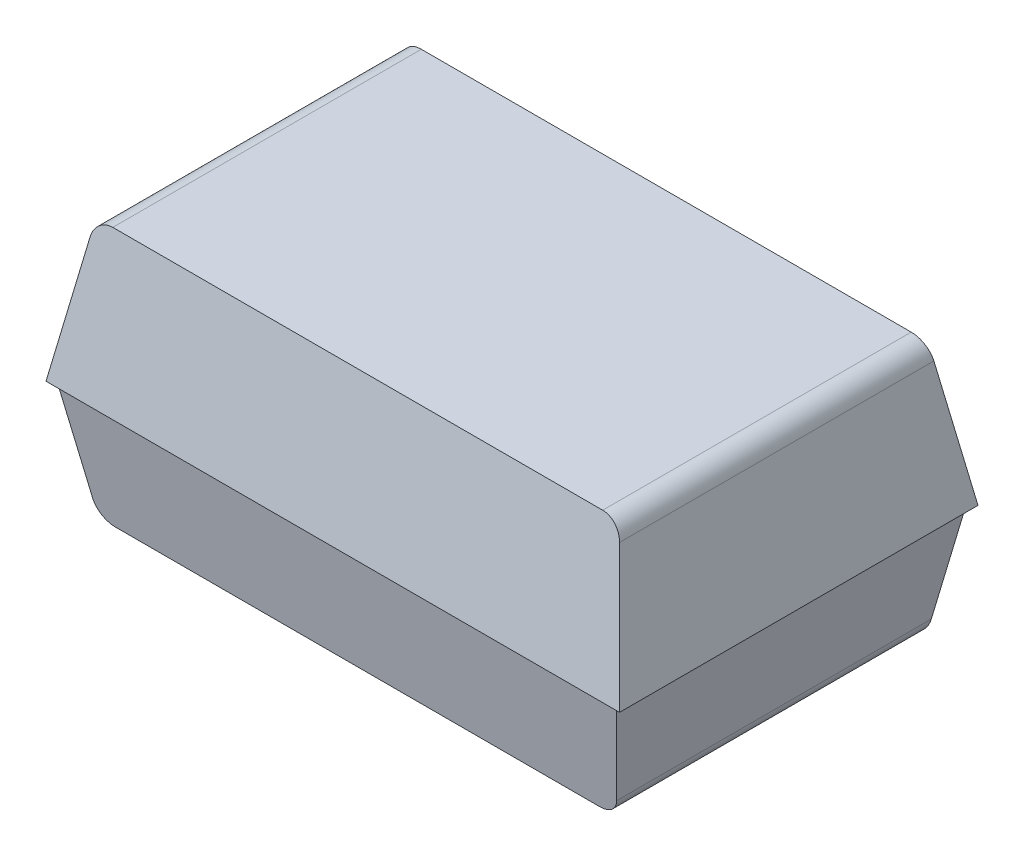
ISO-10303-21;
HEADER;
FILE_DESCRIPTION(('STEP AP214'),'2;1');
FILE_NAME('part.step','',(''),(''),'','','');
FILE_SCHEMA(('AUTOMOTIVE_DESIGN { 1 0 10303 214 1 1 1 1 }'));
ENDSEC;
DATA;
#1=APPLICATION_CONTEXT('core data for automotive mechanical design processes');
#2=APPLICATION_PROTOCOL_DEFINITION('international standard','automotive_design',2000,#1);
#3=PRODUCT_CONTEXT('',#1,'mechanical');
#4=PRODUCT('Part','Part','',(#3));
#5=PRODUCT_RELATED_PRODUCT_CATEGORY('part','',(#4));
#6=PRODUCT_DEFINITION_FORMATION('','',#4);
#7=PRODUCT_DEFINITION_CONTEXT('part definition',#1,'design');
#8=PRODUCT_DEFINITION('design','',#6,#7);
#9=PRODUCT_DEFINITION_SHAPE('','',#8);
#10=(LENGTH_UNIT() NAMED_UNIT(*) SI_UNIT(.MILLI.,.METRE.));
#11=(NAMED_UNIT(*) PLANE_ANGLE_UNIT() SI_UNIT($,.RADIAN.));
#12=(NAMED_UNIT(*) SI_UNIT($,.STERADIAN.) SOLID_ANGLE_UNIT());
#13=UNCERTAINTY_MEASURE_WITH_UNIT(LENGTH_MEASURE(1.E-05),#10,'distance_accuracy_value','');
#14=(GEOMETRIC_REPRESENTATION_CONTEXT(3) GLOBAL_UNCERTAINTY_ASSIGNED_CONTEXT((#13)) GLOBAL_UNIT_ASSIGNED_CONTEXT((#10,
#11,#12)) REPRESENTATION_CONTEXT('',''));
#15=CARTESIAN_POINT('',(0.,0.,0.));
#16=DIRECTION('',(0.,0.,1.));
#17=DIRECTION('',(1.,0.,0.));
#18=AXIS2_PLACEMENT_3D('',#15,#16,#17);
#19=CARTESIAN_POINT('',(0.,-0.406,0.));
#20=DIRECTION('',(0.,-1.,0.));
#21=DIRECTION('',(0.,0.,-1.));
#22=AXIS2_PLACEMENT_3D('',#19,#20,#21);
#23=PLANE('',#22);
#24=DIRECTION('',(1.,0.,0.));
#25=VECTOR('',#24,1.);
#26=CARTESIAN_POINT('',(1.2,-0.406000000000055,0.53841124583231));
#27=LINE('',#26,#25);
#28=CARTESIAN_POINT('',(-0.84467427165,-0.406000000000014,0.538411245832314));
#29=VERTEX_POINT('',#28);
#30=CARTESIAN_POINT('',(0.84467427165,-0.406000000000014,0.538411245832314));
#31=VERTEX_POINT('',#30);
#32=EDGE_CURVE('E144',#29,#31,#27,.T.);
#33=ORIENTED_EDGE('',*,*,#32,.F.);
#34=DIRECTION('',(0.,0.,-1.));
#35=VECTOR('',#34,1.);
#36=CARTESIAN_POINT('',(-0.84467427165,-0.406,1.079009571055));
#37=LINE('',#36,#35);
#38=CARTESIAN_POINT('',(-0.84467427165,-0.406000000000014,-0.538411245832314));
#39=VERTEX_POINT('',#38);
#40=EDGE_CURVE('E97',#39,#29,#37,.F.);
#41=ORIENTED_EDGE('',*,*,#40,.F.);
#42=DIRECTION('',(1.,0.,0.));
#43=VECTOR('',#42,1.);
#44=CARTESIAN_POINT('',(1.2,-0.406000000000055,-0.53841124583231));
#45=LINE('',#44,#43);
#46=CARTESIAN_POINT('',(0.84467427165,-0.406000000000014,-0.538411245832314));
#47=VERTEX_POINT('',#46);
#48=EDGE_CURVE('E169',#39,#47,#45,.T.);
#49=ORIENTED_EDGE('',*,*,#48,.T.);
#50=DIRECTION('',(0.,0.,1.));
#51=VECTOR('',#50,1.);
#52=CARTESIAN_POINT('',(0.84467427165,-0.406,-1.078995464428));
#53=LINE('',#52,#51);
#54=EDGE_CURVE('E114',#31,#47,#53,.F.);
#55=ORIENTED_EDGE('',*,*,#54,.F.);
#56=EDGE_LOOP('',(#33,#41,#49,#55));
#57=FACE_BOUND('',#56,.T.);
#58=ADVANCED_FACE('F17',(#57),#23,.T.);
#59=CARTESIAN_POINT('',(0.84467427165,-0.336,-1.078995464428));
#60=DIRECTION('',(0.,0.,1.));
#61=DIRECTION('',(1.,0.,0.));
#62=AXIS2_PLACEMENT_3D('',#59,#60,#61);
#63=CYLINDRICAL_SURFACE('',#62,0.07);
#64=CARTESIAN_POINT('',(0.84467427165,-0.336,0.55075413448192));
#65=DIRECTION('',(0.,-0.173648177667033,0.98480775301219));
#66=DIRECTION('',(0.,0.98480775301219,0.173648177667033));
#67=AXIS2_PLACEMENT_3D('',#64,#65,#66);
#68=ELLIPSE('',#67,0.0710798628320034,0.07);
#69=CARTESIAN_POINT('',(0.913610814360793,-0.348155372436795,0.548610814360751));
#70=VERTEX_POINT('',#69);
#71=EDGE_CURVE('E163',#31,#70,#68,.T.);
#72=ORIENTED_EDGE('',*,*,#71,.F.);
#73=ORIENTED_EDGE('',*,*,#54,.T.);
#74=CARTESIAN_POINT('',(0.84467427165,-0.336,-0.550754134481919));
#75=DIRECTION('',(0.,0.173648177667033,0.98480775301219));
#76=DIRECTION('',(0.,-0.98480775301219,0.173648177667033));
#77=AXIS2_PLACEMENT_3D('',#74,#75,#76);
#78=ELLIPSE('',#77,0.0710798628320034,0.07);
#79=CARTESIAN_POINT('',(0.913610814360788,-0.348155372436823,-0.548610814360885));
#80=VERTEX_POINT('',#79);
#81=EDGE_CURVE('E167',#47,#80,#78,.T.);
#82=ORIENTED_EDGE('',*,*,#81,.T.);
#83=DIRECTION('',(0.,0.,1.));
#84=VECTOR('',#83,1.);
#85=CARTESIAN_POINT('',(0.913610814360724,-0.348155372436951,0.61));
#86=LINE('',#85,#84);
#87=EDGE_CURVE('E132',#80,#70,#86,.T.);
#88=ORIENTED_EDGE('',*,*,#87,.T.);
#89=EDGE_LOOP('',(#72,#73,#82,#88));
#90=FACE_BOUND('',#89,.T.);
#91=ADVANCED_FACE('F345',(#90),#63,.T.);
#92=CARTESIAN_POINT('',(-0.84467427165,-0.336,1.079009571055));
#93=DIRECTION('',(0.,0.,-1.));
#94=DIRECTION('',(-1.,0.,0.));
#95=AXIS2_PLACEMENT_3D('',#92,#93,#94);
#96=CYLINDRICAL_SURFACE('',#95,0.07);
#97=CARTESIAN_POINT('',(-0.84467427165,-0.336,-0.55075413448192));
#98=DIRECTION('',(0.,0.173648177667033,0.98480775301219));
#99=DIRECTION('',(0.,0.98480775301219,-0.173648177667033));
#100=AXIS2_PLACEMENT_3D('',#97,#98,#99);
#101=ELLIPSE('',#100,0.0710798628320034,0.07);
#102=CARTESIAN_POINT('',(-0.913610814360793,-0.348155372436795,-0.548610814360751));
#103=VERTEX_POINT('',#102);
#104=EDGE_CURVE('E117',#103,#39,#101,.T.);
#105=ORIENTED_EDGE('',*,*,#104,.T.);
#106=ORIENTED_EDGE('',*,*,#40,.T.);
#107=CARTESIAN_POINT('',(-0.84467427165,-0.336,0.550754134481919));
#108=DIRECTION('',(0.,-0.173648177667033,0.98480775301219));
#109=DIRECTION('',(0.,-0.98480775301219,-0.173648177667033));
#110=AXIS2_PLACEMENT_3D('',#107,#108,#109);
#111=ELLIPSE('',#110,0.0710798628320034,0.07);
#112=CARTESIAN_POINT('',(-0.913610814360793,-0.348155372436795,0.548610814360751));
#113=VERTEX_POINT('',#112);
#114=EDGE_CURVE('E158',#113,#29,#111,.T.);
#115=ORIENTED_EDGE('',*,*,#114,.F.);
#116=DIRECTION('',(0.,0.,1.));
#117=VECTOR('',#116,1.);
#118=CARTESIAN_POINT('',(-0.913610814360724,-0.348155372436951,0.61));
#119=LINE('',#118,#117);
#120=EDGE_CURVE('E115',#103,#113,#119,.T.);
#121=ORIENTED_EDGE('',*,*,#120,.F.);
#122=EDGE_LOOP('',(#105,#106,#115,#121));
#123=FACE_BOUND('',#122,.T.);
#124=ADVANCED_FACE('F337',(#123),#96,.T.);
#125=CARTESIAN_POINT('',(1.2,0.494,-0.53789447153));
#126=DIRECTION('',(0.,-0.173648177667033,0.98480775301219));
#127=DIRECTION('',(0.,-0.98480775301219,-0.173648177667033));
#128=AXIS2_PLACEMENT_3D('',#125,#126,#127);
#129=PLANE('',#128);
#130=DIRECTION('',(1.,0.,0.));
#131=VECTOR('',#130,1.);
#132=CARTESIAN_POINT('',(0.,0.,-0.625));
#133=LINE('',#132,#131);
#134=CARTESIAN_POINT('',(1.00000000000002,0.,-0.625000000000012));
#135=VERTEX_POINT('',#134);
#136=CARTESIAN_POINT('',(-1.00000000000001,0.,-0.625));
#137=VERTEX_POINT('',#136);
#138=EDGE_CURVE('E193',#135,#137,#133,.F.);
#139=ORIENTED_EDGE('',*,*,#138,.T.);
#140=DIRECTION('',(-0.171087869746174,-0.970287525248008,-0.171087869744795));
#141=VECTOR('',#140,1.);
#142=CARTESIAN_POINT('',(-0.923094040058414,0.436155372436897,-0.548094040059));
#143=LINE('',#142,#141);
#144=CARTESIAN_POINT('',(-0.923094040058731,0.436155372436813,-0.548094040058725));
#145=VERTEX_POINT('',#144);
#146=EDGE_CURVE('E161',#145,#137,#143,.T.);
#147=ORIENTED_EDGE('',*,*,#146,.F.);
#148=CARTESIAN_POINT('',(-0.854157497348,0.424,-0.5502373601796));
#149=DIRECTION('',(0.,-0.173648177667033,0.98480775301219));
#150=DIRECTION('',(0.,0.98480775301219,0.173648177667033));
#151=AXIS2_PLACEMENT_3D('',#148,#149,#150);
#152=ELLIPSE('',#151,0.0710798628320034,0.07);
#153=CARTESIAN_POINT('',(-0.854157497348,0.494,-0.53789447153));
#154=VERTEX_POINT('',#153);
#155=EDGE_CURVE('E106',#154,#145,#152,.T.);
#156=ORIENTED_EDGE('',*,*,#155,.F.);
#157=DIRECTION('',(1.,0.,0.));
#158=VECTOR('',#157,1.);
#159=CARTESIAN_POINT('',(1.2,0.494,-0.53789447153));
#160=LINE('',#159,#158);
#161=CARTESIAN_POINT('',(0.854157497348,0.494,-0.53789447153));
#162=VERTEX_POINT('',#161);
#163=EDGE_CURVE('E96',#162,#154,#160,.F.);
#164=ORIENTED_EDGE('',*,*,#163,.F.);
#165=CARTESIAN_POINT('',(0.854157497348,0.424,-0.5502373601796));
#166=DIRECTION('',(0.,-0.173648177667033,0.98480775301219));
#167=DIRECTION('',(0.,-0.98480775301219,-0.173648177667033));
#168=AXIS2_PLACEMENT_3D('',#165,#166,#167);
#169=ELLIPSE('',#168,0.0710798628320034,0.07);
#170=CARTESIAN_POINT('',(0.923094040058882,0.436155372436789,-0.548094040058432));
#171=VERTEX_POINT('',#170);
#172=EDGE_CURVE('E20',#171,#162,#169,.T.);
#173=ORIENTED_EDGE('',*,*,#172,.F.);
#174=DIRECTION('',(-0.171087869744795,0.970287525248008,0.171087869746174));
#175=VECTOR('',#174,1.);
#176=CARTESIAN_POINT('',(1.,0.,-0.625000000000034));
#177=LINE('',#176,#175);
#178=EDGE_CURVE('E86',#135,#171,#177,.T.);
#179=ORIENTED_EDGE('',*,*,#178,.F.);
#180=EDGE_LOOP('',(#139,#147,#156,#164,#173,#179));
#181=FACE_BOUND('',#180,.T.);
#182=ADVANCED_FACE('F104',(#181),#129,.F.);
#183=CARTESIAN_POINT('',(-0.975,0.,0.61));
#184=DIRECTION('',(-0.98480775301219,-0.173648177667033,0.));
#185=DIRECTION('',(0.173648177667033,-0.98480775301219,0.));
#186=AXIS2_PLACEMENT_3D('',#183,#184,#185);
#187=PLANE('',#186);
#188=DIRECTION('',(0.171087869745387,-0.970287525247907,0.171087869746157));
#189=VECTOR('',#188,1.);
#190=CARTESIAN_POINT('',(-0.975000000000001,0.,-0.61));
#191=LINE('',#190,#189);
#192=CARTESIAN_POINT('',(-0.975000000000001,0.,-0.61));
#193=VERTEX_POINT('',#192);
#194=EDGE_CURVE('E135',#193,#103,#191,.T.);
#195=ORIENTED_EDGE('',*,*,#194,.T.);
#196=ORIENTED_EDGE('',*,*,#120,.T.);
#197=DIRECTION('',(0.171087869745387,-0.970287525247907,-0.171087869746157));
#198=VECTOR('',#197,1.);
#199=CARTESIAN_POINT('',(-0.975000000000001,0.,0.61));
#200=LINE('',#199,#198);
#201=CARTESIAN_POINT('',(-0.975000000000001,0.,0.61));
#202=VERTEX_POINT('',#201);
#203=EDGE_CURVE('E162',#202,#113,#200,.T.);
#204=ORIENTED_EDGE('',*,*,#203,.F.);
#205=DIRECTION('',(0.,0.,1.));
#206=VECTOR('',#205,1.);
#207=CARTESIAN_POINT('',(-0.975,0.,0.));
#208=LINE('',#207,#206);
#209=EDGE_CURVE('E125',#202,#193,#208,.F.);
#210=ORIENTED_EDGE('',*,*,#209,.T.);
#211=EDGE_LOOP('',(#195,#196,#204,#210));
#212=FACE_BOUND('',#211,.T.);
#213=ADVANCED_FACE('F320',(#212),#187,.T.);
#214=CARTESIAN_POINT('',(1.2,0.,-0.61));
#215=DIRECTION('',(0.,0.173648177667033,0.98480775301219));
#216=DIRECTION('',(0.,-0.98480775301219,0.173648177667033));
#217=AXIS2_PLACEMENT_3D('',#214,#215,#216);
#218=PLANE('',#217);
#219=DIRECTION('',(1.,0.,0.));
#220=VECTOR('',#219,1.);
#221=CARTESIAN_POINT('',(0.,0.,-0.61));
#222=LINE('',#221,#220);
#223=CARTESIAN_POINT('',(0.975,0.,-0.61));
#224=VERTEX_POINT('',#223);
#225=EDGE_CURVE('E128',#193,#224,#222,.T.);
#226=ORIENTED_EDGE('',*,*,#225,.T.);
#227=DIRECTION('',(-0.171087869746157,-0.970287525247907,0.171087869745386));
#228=VECTOR('',#227,1.);
#229=CARTESIAN_POINT('',(0.975,0.,-0.61));
#230=LINE('',#229,#228);
#231=EDGE_CURVE('E134',#224,#80,#230,.T.);
#232=ORIENTED_EDGE('',*,*,#231,.T.);
#233=ORIENTED_EDGE('',*,*,#81,.F.);
#234=ORIENTED_EDGE('',*,*,#48,.F.);
#235=ORIENTED_EDGE('',*,*,#104,.F.);
#236=ORIENTED_EDGE('',*,*,#194,.F.);
#237=EDGE_LOOP('',(#226,#232,#233,#234,#235,#236));
#238=FACE_BOUND('',#237,.T.);
#239=ADVANCED_FACE('F311',(#238),#218,.F.);
#240=CARTESIAN_POINT('',(0.975,0.,0.61));
#241=DIRECTION('',(-0.98480775301219,0.173648177667033,0.));
#242=DIRECTION('',(-0.173648177667033,-0.98480775301219,0.));
#243=AXIS2_PLACEMENT_3D('',#240,#241,#242);
#244=PLANE('',#243);
#245=DIRECTION('',(0.,0.,1.));
#246=VECTOR('',#245,1.);
#247=CARTESIAN_POINT('',(0.975,0.,0.));
#248=LINE('',#247,#246);
#249=CARTESIAN_POINT('',(0.975,0.,0.61));
#250=VERTEX_POINT('',#249);
#251=EDGE_CURVE('E122',#224,#250,#248,.T.);
#252=ORIENTED_EDGE('',*,*,#251,.T.);
#253=DIRECTION('',(0.171087869745386,0.970287525247907,0.171087869746157));
#254=VECTOR('',#253,1.);
#255=CARTESIAN_POINT('',(0.913610814361,-0.348155372436951,0.548610814360724));
#256=LINE('',#255,#254);
#257=EDGE_CURVE('E166',#70,#250,#256,.T.);
#258=ORIENTED_EDGE('',*,*,#257,.F.);
#259=ORIENTED_EDGE('',*,*,#87,.F.);
#260=ORIENTED_EDGE('',*,*,#231,.F.);
#261=EDGE_LOOP('',(#252,#258,#259,#260));
#262=FACE_BOUND('',#261,.T.);
#263=ADVANCED_FACE('F302',(#262),#244,.F.);
#264=CARTESIAN_POINT('',(1.2,0.,0.61));
#265=DIRECTION('',(0.,-0.173648177667033,0.98480775301219));
#266=DIRECTION('',(0.,-0.98480775301219,-0.173648177667033));
#267=AXIS2_PLACEMENT_3D('',#264,#265,#266);
#268=PLANE('',#267);
#269=ORIENTED_EDGE('',*,*,#203,.T.);
#270=ORIENTED_EDGE('',*,*,#114,.T.);
#271=ORIENTED_EDGE('',*,*,#32,.T.);
#272=ORIENTED_EDGE('',*,*,#71,.T.);
#273=ORIENTED_EDGE('',*,*,#257,.T.);
#274=DIRECTION('',(1.,0.,0.));
#275=VECTOR('',#274,1.);
#276=CARTESIAN_POINT('',(0.,0.,0.61));
#277=LINE('',#276,#275);
#278=EDGE_CURVE('E118',#250,#202,#277,.F.);
#279=ORIENTED_EDGE('',*,*,#278,.T.);
#280=EDGE_LOOP('',(#269,#270,#271,#272,#273,#279));
#281=FACE_BOUND('',#280,.T.);
#282=ADVANCED_FACE('F293',(#281),#268,.T.);
#283=CARTESIAN_POINT('',(-0.91289447153,0.494,0.625));
#284=DIRECTION('',(-0.98480775301219,0.173648177667033,0.));
#285=DIRECTION('',(-0.173648177667033,-0.98480775301219,0.));
#286=AXIS2_PLACEMENT_3D('',#283,#284,#285);
#287=PLANE('',#286);
#288=DIRECTION('',(-0.171087869744795,-0.970287525248008,0.171087869746174));
#289=VECTOR('',#288,1.);
#290=CARTESIAN_POINT('',(-0.923094040059001,0.436155372436897,0.548094040058414));
#291=LINE('',#290,#289);
#292=CARTESIAN_POINT('',(-0.923094040058882,0.436155372436789,0.548094040058432));
#293=VERTEX_POINT('',#292);
#294=CARTESIAN_POINT('',(-1.,0.,0.625000000000034));
#295=VERTEX_POINT('',#294);
#296=EDGE_CURVE('E156',#293,#295,#291,.T.);
#297=ORIENTED_EDGE('',*,*,#296,.F.);
#298=DIRECTION('',(0.,0.,1.));
#299=VECTOR('',#298,1.);
#300=CARTESIAN_POINT('',(-0.923094040058805,0.436155372436966,-1.077973923262));
#301=LINE('',#300,#299);
#302=EDGE_CURVE('E157',#145,#293,#301,.T.);
#303=ORIENTED_EDGE('',*,*,#302,.F.);
#304=ORIENTED_EDGE('',*,*,#146,.T.);
#305=DIRECTION('',(0.,0.,1.));
#306=VECTOR('',#305,1.);
#307=CARTESIAN_POINT('',(-1.,0.,0.));
#308=LINE('',#307,#306);
#309=EDGE_CURVE('E129',#137,#295,#308,.T.);
#310=ORIENTED_EDGE('',*,*,#309,.T.);
#311=EDGE_LOOP('',(#297,#303,#304,#310));
#312=FACE_BOUND('',#311,.T.);
#313=ADVANCED_FACE('F238',(#312),#287,.T.);
#314=CARTESIAN_POINT('',(0.,0.,0.));
#315=DIRECTION('',(0.,1.,0.));
#316=DIRECTION('',(0.,0.,1.));
#317=AXIS2_PLACEMENT_3D('',#314,#315,#316);
#318=PLANE('',#317);
#319=ORIENTED_EDGE('',*,*,#251,.F.);
#320=ORIENTED_EDGE('',*,*,#225,.F.);
#321=ORIENTED_EDGE('',*,*,#209,.F.);
#322=ORIENTED_EDGE('',*,*,#278,.F.);
#323=EDGE_LOOP('',(#319,#320,#321,#322));
#324=FACE_BOUND('',#323,.T.);
#325=ORIENTED_EDGE('',*,*,#309,.F.);
#326=ORIENTED_EDGE('',*,*,#138,.F.);
#327=DIRECTION('',(0.,0.,1.));
#328=VECTOR('',#327,1.);
#329=CARTESIAN_POINT('',(1.00000000000003,0.,0.625));
#330=LINE('',#329,#328);
#331=CARTESIAN_POINT('',(1.00000000000001,0.,0.625000000000034));
#332=VERTEX_POINT('',#331);
#333=EDGE_CURVE('E121',#135,#332,#330,.T.);
#334=ORIENTED_EDGE('',*,*,#333,.T.);
#335=DIRECTION('',(1.,0.,0.));
#336=VECTOR('',#335,1.);
#337=CARTESIAN_POINT('',(1.2,0.,0.625000000000034));
#338=LINE('',#337,#336);
#339=EDGE_CURVE('E205',#295,#332,#338,.T.);
#340=ORIENTED_EDGE('',*,*,#339,.F.);
#341=EDGE_LOOP('',(#325,#326,#334,#340));
#342=FACE_BOUND('',#341,.T.);
#343=ADVANCED_FACE('F229',(#324,#342),#318,.F.);
#344=CARTESIAN_POINT('',(0.91289447153,0.494,0.625));
#345=DIRECTION('',(-0.98480775301219,-0.173648177667033,0.));
#346=DIRECTION('',(0.173648177667033,-0.98480775301219,0.));
#347=AXIS2_PLACEMENT_3D('',#344,#345,#346);
#348=PLANE('',#347);
#349=ORIENTED_EDGE('',*,*,#333,.F.);
#350=ORIENTED_EDGE('',*,*,#178,.T.);
#351=DIRECTION('',(0.,0.,-1.));
#352=VECTOR('',#351,1.);
#353=CARTESIAN_POINT('',(0.923094040058805,0.436155372436966,1.077959830175));
#354=LINE('',#353,#352);
#355=CARTESIAN_POINT('',(0.923094040058882,0.436155372436789,0.548094040058431));
#356=VERTEX_POINT('',#355);
#357=EDGE_CURVE('E93',#356,#171,#354,.T.);
#358=ORIENTED_EDGE('',*,*,#357,.F.);
#359=DIRECTION('',(-0.171087869744795,0.970287525248008,-0.171087869746174));
#360=VECTOR('',#359,1.);
#361=CARTESIAN_POINT('',(1.,0.,0.625000000000034));
#362=LINE('',#361,#360);
#363=EDGE_CURVE('E152',#332,#356,#362,.T.);
#364=ORIENTED_EDGE('',*,*,#363,.F.);
#365=EDGE_LOOP('',(#349,#350,#358,#364));
#366=FACE_BOUND('',#365,.T.);
#367=ADVANCED_FACE('F226',(#366),#348,.F.);
#368=CARTESIAN_POINT('',(-0.854157497348,0.424,-1.077973923262));
#369=DIRECTION('',(0.,0.,1.));
#370=DIRECTION('',(1.,0.,0.));
#371=AXIS2_PLACEMENT_3D('',#368,#369,#370);
#372=CYLINDRICAL_SURFACE('',#371,0.07);
#373=CARTESIAN_POINT('',(-0.854157497348,0.424,0.5502373601796));
#374=DIRECTION('',(0.,0.173648177667033,0.98480775301219));
#375=DIRECTION('',(0.,-0.98480775301219,0.173648177667033));
#376=AXIS2_PLACEMENT_3D('',#373,#374,#375);
#377=ELLIPSE('',#376,0.0710798628320034,0.07);
#378=CARTESIAN_POINT('',(-0.854157497348,0.494,0.53789447153));
#379=VERTEX_POINT('',#378);
#380=EDGE_CURVE('E153',#379,#293,#377,.T.);
#381=ORIENTED_EDGE('',*,*,#380,.F.);
#382=DIRECTION('',(0.,0.,1.));
#383=VECTOR('',#382,1.);
#384=CARTESIAN_POINT('',(-0.854157497348,0.494,0.));
#385=LINE('',#384,#383);
#386=EDGE_CURVE('E213',#154,#379,#385,.T.);
#387=ORIENTED_EDGE('',*,*,#386,.F.);
#388=ORIENTED_EDGE('',*,*,#155,.T.);
#389=ORIENTED_EDGE('',*,*,#302,.T.);
#390=EDGE_LOOP('',(#381,#387,#388,#389));
#391=FACE_BOUND('',#390,.T.);
#392=ADVANCED_FACE('F228',(#391),#372,.T.);
#393=CARTESIAN_POINT('',(1.2,0.494,0.53789447153));
#394=DIRECTION('',(0.,0.173648177667033,0.98480775301219));
#395=DIRECTION('',(0.,-0.98480775301219,0.173648177667033));
#396=AXIS2_PLACEMENT_3D('',#393,#394,#395);
#397=PLANE('',#396);
#398=ORIENTED_EDGE('',*,*,#363,.T.);
#399=CARTESIAN_POINT('',(0.854157497348,0.424,0.5502373601796));
#400=DIRECTION('',(0.,0.173648177667033,0.98480775301219));
#401=DIRECTION('',(0.,0.98480775301219,-0.173648177667033));
#402=AXIS2_PLACEMENT_3D('',#399,#400,#401);
#403=ELLIPSE('',#402,0.0710798628320034,0.07);
#404=CARTESIAN_POINT('',(0.854157497348,0.494,0.53789447153));
#405=VERTEX_POINT('',#404);
#406=EDGE_CURVE('E35',#405,#356,#403,.F.);
#407=ORIENTED_EDGE('',*,*,#406,.F.);
#408=DIRECTION('',(1.,0.,0.));
#409=VECTOR('',#408,1.);
#410=CARTESIAN_POINT('',(0.,0.494,0.53789447153));
#411=LINE('',#410,#409);
#412=EDGE_CURVE('E26',#379,#405,#411,.T.);
#413=ORIENTED_EDGE('',*,*,#412,.F.);
#414=ORIENTED_EDGE('',*,*,#380,.T.);
#415=ORIENTED_EDGE('',*,*,#296,.T.);
#416=ORIENTED_EDGE('',*,*,#339,.T.);
#417=EDGE_LOOP('',(#398,#407,#413,#414,#415,#416));
#418=FACE_BOUND('',#417,.T.);
#419=ADVANCED_FACE('F224',(#418),#397,.T.);
#420=CARTESIAN_POINT('',(0.854157497348,0.424,1.077959830175));
#421=DIRECTION('',(0.,0.,-1.));
#422=DIRECTION('',(-1.,0.,0.));
#423=AXIS2_PLACEMENT_3D('',#420,#421,#422);
#424=CYLINDRICAL_SURFACE('',#423,0.07);
#425=ORIENTED_EDGE('',*,*,#172,.T.);
#426=DIRECTION('',(0.,0.,1.));
#427=VECTOR('',#426,1.);
#428=CARTESIAN_POINT('',(0.854157497348,0.494,0.));
#429=LINE('',#428,#427);
#430=EDGE_CURVE('E11',#405,#162,#429,.F.);
#431=ORIENTED_EDGE('',*,*,#430,.F.);
#432=ORIENTED_EDGE('',*,*,#406,.T.);
#433=ORIENTED_EDGE('',*,*,#357,.T.);
#434=EDGE_LOOP('',(#425,#431,#432,#433));
#435=FACE_BOUND('',#434,.T.);
#436=ADVANCED_FACE('F91',(#435),#424,.T.);
#437=CARTESIAN_POINT('',(0.,0.494,0.));
#438=DIRECTION('',(0.,1.,0.));
#439=DIRECTION('',(0.,0.,1.));
#440=AXIS2_PLACEMENT_3D('',#437,#438,#439);
#441=PLANE('',#440);
#442=ORIENTED_EDGE('',*,*,#412,.T.);
#443=ORIENTED_EDGE('',*,*,#430,.T.);
#444=ORIENTED_EDGE('',*,*,#163,.T.);
#445=ORIENTED_EDGE('',*,*,#386,.T.);
#446=EDGE_LOOP('',(#442,#443,#444,#445));
#447=FACE_BOUND('',#446,.T.);
#448=ADVANCED_FACE('F99',(#447),#441,.T.);
#449=CLOSED_SHELL('',(#58,#91,#124,#182,#213,#239,#263,#282,#313,#343,#367,#392,#419,#436,#448));
#450=MANIFOLD_SOLID_BREP('B1',#449);
#451=ADVANCED_BREP_SHAPE_REPRESENTATION('',(#18,#450),#14);
#452=SHAPE_DEFINITION_REPRESENTATION(#9,#451);
ENDSEC;
END-ISO-10303-21;
